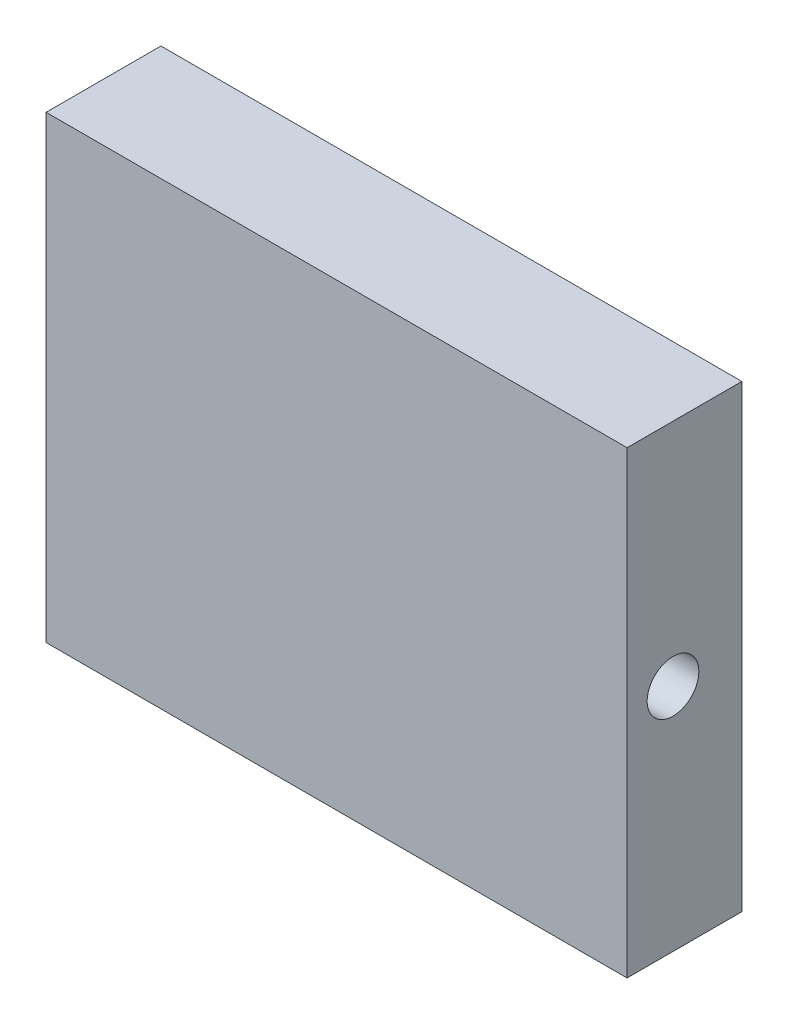
ISO-10303-21;
HEADER;
FILE_DESCRIPTION(('STEP AP214'),'2;1');
FILE_NAME('part.step','',(''),(''),'','','');
FILE_SCHEMA(('AUTOMOTIVE_DESIGN { 1 0 10303 214 1 1 1 1 }'));
ENDSEC;
DATA;
#1=APPLICATION_CONTEXT('core data for automotive mechanical design processes');
#2=APPLICATION_PROTOCOL_DEFINITION('international standard','automotive_design',2000,#1);
#3=PRODUCT_CONTEXT('',#1,'mechanical');
#4=PRODUCT('Part','Part','',(#3));
#5=PRODUCT_RELATED_PRODUCT_CATEGORY('part','',(#4));
#6=PRODUCT_DEFINITION_FORMATION('','',#4);
#7=PRODUCT_DEFINITION_CONTEXT('part definition',#1,'design');
#8=PRODUCT_DEFINITION('design','',#6,#7);
#9=PRODUCT_DEFINITION_SHAPE('','',#8);
#10=(LENGTH_UNIT() NAMED_UNIT(*) SI_UNIT(.MILLI.,.METRE.));
#11=(NAMED_UNIT(*) PLANE_ANGLE_UNIT() SI_UNIT($,.RADIAN.));
#12=(NAMED_UNIT(*) SI_UNIT($,.STERADIAN.) SOLID_ANGLE_UNIT());
#13=UNCERTAINTY_MEASURE_WITH_UNIT(LENGTH_MEASURE(1.E-05),#10,'distance_accuracy_value','');
#14=(GEOMETRIC_REPRESENTATION_CONTEXT(3) GLOBAL_UNCERTAINTY_ASSIGNED_CONTEXT((#13)) GLOBAL_UNIT_ASSIGNED_CONTEXT((#10,
#11,#12)) REPRESENTATION_CONTEXT('',''));
#15=CARTESIAN_POINT('',(0.,0.,0.));
#16=DIRECTION('',(0.,0.,1.));
#17=DIRECTION('',(1.,0.,0.));
#18=AXIS2_PLACEMENT_3D('',#15,#16,#17);
#19=CARTESIAN_POINT('',(0.,0.,10.));
#20=DIRECTION('',(1.,0.,0.));
#21=DIRECTION('',(0.,0.,-1.));
#22=AXIS2_PLACEMENT_3D('',#19,#20,#21);
#23=PLANE('',#22);
#24=DIRECTION('',(0.,-1.,0.));
#25=VECTOR('',#24,1.);
#26=CARTESIAN_POINT('',(0.,0.,0.));
#27=LINE('',#26,#25);
#28=CARTESIAN_POINT('',(0.,40.,0.));
#29=VERTEX_POINT('',#28);
#30=CARTESIAN_POINT('',(0.,0.,0.));
#31=VERTEX_POINT('',#30);
#32=EDGE_CURVE('E73',#29,#31,#27,.T.);
#33=ORIENTED_EDGE('',*,*,#32,.T.);
#34=DIRECTION('',(0.,0.,-1.));
#35=VECTOR('',#34,1.);
#36=CARTESIAN_POINT('',(0.,0.,10.));
#37=LINE('',#36,#35);
#38=CARTESIAN_POINT('',(0.,0.,10.));
#39=VERTEX_POINT('',#38);
#40=EDGE_CURVE('E11',#39,#31,#37,.T.);
#41=ORIENTED_EDGE('',*,*,#40,.F.);
#42=DIRECTION('',(0.,-1.,0.));
#43=VECTOR('',#42,1.);
#44=CARTESIAN_POINT('',(0.,0.,10.));
#45=LINE('',#44,#43);
#46=CARTESIAN_POINT('',(0.,40.,10.));
#47=VERTEX_POINT('',#46);
#48=EDGE_CURVE('E96',#47,#39,#45,.T.);
#49=ORIENTED_EDGE('',*,*,#48,.F.);
#50=DIRECTION('',(0.,0.,-1.));
#51=VECTOR('',#50,1.);
#52=CARTESIAN_POINT('',(0.,40.,10.));
#53=LINE('',#52,#51);
#54=EDGE_CURVE('E85',#47,#29,#53,.T.);
#55=ORIENTED_EDGE('',*,*,#54,.T.);
#56=EDGE_LOOP('',(#33,#41,#49,#55));
#57=FACE_BOUND('',#56,.T.);
#58=ADVANCED_FACE('F29',(#57),#23,.F.);
#59=CARTESIAN_POINT('',(0.,0.,10.));
#60=DIRECTION('',(0.,1.,0.));
#61=DIRECTION('',(0.,0.,1.));
#62=AXIS2_PLACEMENT_3D('',#59,#60,#61);
#63=PLANE('',#62);
#64=DIRECTION('',(1.,0.,0.));
#65=VECTOR('',#64,1.);
#66=CARTESIAN_POINT('',(0.,0.,0.));
#67=LINE('',#66,#65);
#68=CARTESIAN_POINT('',(50.6,0.,0.));
#69=VERTEX_POINT('',#68);
#70=EDGE_CURVE('E69',#31,#69,#67,.T.);
#71=ORIENTED_EDGE('',*,*,#70,.T.);
#72=DIRECTION('',(0.,0.,-1.));
#73=VECTOR('',#72,1.);
#74=CARTESIAN_POINT('',(50.6,0.,10.));
#75=LINE('',#74,#73);
#76=CARTESIAN_POINT('',(50.6,0.,10.));
#77=VERTEX_POINT('',#76);
#78=EDGE_CURVE('E36',#77,#69,#75,.T.);
#79=ORIENTED_EDGE('',*,*,#78,.F.);
#80=DIRECTION('',(1.,0.,0.));
#81=VECTOR('',#80,1.);
#82=CARTESIAN_POINT('',(0.,0.,10.));
#83=LINE('',#82,#81);
#84=EDGE_CURVE('E81',#39,#77,#83,.T.);
#85=ORIENTED_EDGE('',*,*,#84,.F.);
#86=ORIENTED_EDGE('',*,*,#40,.T.);
#87=EDGE_LOOP('',(#71,#79,#85,#86));
#88=FACE_BOUND('',#87,.T.);
#89=ADVANCED_FACE('F80',(#88),#63,.F.);
#90=CARTESIAN_POINT('',(50.6,0.,10.));
#91=DIRECTION('',(-1.,0.,0.));
#92=DIRECTION('',(0.,0.,1.));
#93=AXIS2_PLACEMENT_3D('',#90,#91,#92);
#94=PLANE('',#93);
#95=CARTESIAN_POINT('',(50.6,20.,5.99999999999995));
#96=DIRECTION('',(1.,0.,0.));
#97=DIRECTION('',(0.,0.,-1.));
#98=AXIS2_PLACEMENT_3D('',#95,#96,#97);
#99=CIRCLE('',#98,2.25);
#100=CARTESIAN_POINT('',(50.6,20.,3.74999999999995));
#101=VERTEX_POINT('',#100);
#102=EDGE_CURVE('E89',#101,#101,#99,.T.);
#103=ORIENTED_EDGE('',*,*,#102,.F.);
#104=EDGE_LOOP('',(#103));
#105=FACE_BOUND('',#104,.T.);
#106=DIRECTION('',(0.,1.,0.));
#107=VECTOR('',#106,1.);
#108=CARTESIAN_POINT('',(50.6,0.,0.));
#109=LINE('',#108,#107);
#110=CARTESIAN_POINT('',(50.6,40.,0.));
#111=VERTEX_POINT('',#110);
#112=EDGE_CURVE('E74',#69,#111,#109,.T.);
#113=ORIENTED_EDGE('',*,*,#112,.T.);
#114=DIRECTION('',(0.,0.,-1.));
#115=VECTOR('',#114,1.);
#116=CARTESIAN_POINT('',(50.6,40.,10.));
#117=LINE('',#116,#115);
#118=CARTESIAN_POINT('',(50.6,40.,10.));
#119=VERTEX_POINT('',#118);
#120=EDGE_CURVE('E102',#119,#111,#117,.T.);
#121=ORIENTED_EDGE('',*,*,#120,.F.);
#122=DIRECTION('',(0.,1.,0.));
#123=VECTOR('',#122,1.);
#124=CARTESIAN_POINT('',(50.6,0.,10.));
#125=LINE('',#124,#123);
#126=EDGE_CURVE('E48',#77,#119,#125,.T.);
#127=ORIENTED_EDGE('',*,*,#126,.F.);
#128=ORIENTED_EDGE('',*,*,#78,.T.);
#129=EDGE_LOOP('',(#113,#121,#127,#128));
#130=FACE_BOUND('',#129,.T.);
#131=ADVANCED_FACE('F105',(#105,#130),#94,.F.);
#132=CARTESIAN_POINT('',(0.,40.,10.));
#133=DIRECTION('',(0.,-1.,0.));
#134=DIRECTION('',(0.,0.,-1.));
#135=AXIS2_PLACEMENT_3D('',#132,#133,#134);
#136=PLANE('',#135);
#137=DIRECTION('',(-1.,0.,0.));
#138=VECTOR('',#137,1.);
#139=CARTESIAN_POINT('',(0.,40.,0.));
#140=LINE('',#139,#138);
#141=EDGE_CURVE('E94',#111,#29,#140,.T.);
#142=ORIENTED_EDGE('',*,*,#141,.T.);
#143=ORIENTED_EDGE('',*,*,#54,.F.);
#144=DIRECTION('',(-1.,0.,0.));
#145=VECTOR('',#144,1.);
#146=CARTESIAN_POINT('',(0.,40.,10.));
#147=LINE('',#146,#145);
#148=EDGE_CURVE('E43',#119,#47,#147,.T.);
#149=ORIENTED_EDGE('',*,*,#148,.F.);
#150=ORIENTED_EDGE('',*,*,#120,.T.);
#151=EDGE_LOOP('',(#142,#143,#149,#150));
#152=FACE_BOUND('',#151,.T.);
#153=ADVANCED_FACE('F107',(#152),#136,.F.);
#154=CARTESIAN_POINT('',(0.,40.,10.));
#155=DIRECTION('',(0.,0.,-1.));
#156=DIRECTION('',(-1.,0.,0.));
#157=AXIS2_PLACEMENT_3D('',#154,#155,#156);
#158=PLANE('',#157);
#159=ORIENTED_EDGE('',*,*,#48,.T.);
#160=ORIENTED_EDGE('',*,*,#84,.T.);
#161=ORIENTED_EDGE('',*,*,#126,.T.);
#162=ORIENTED_EDGE('',*,*,#148,.T.);
#163=EDGE_LOOP('',(#159,#160,#161,#162));
#164=FACE_BOUND('',#163,.T.);
#165=ADVANCED_FACE('F108',(#164),#158,.F.);
#166=CARTESIAN_POINT('',(0.,40.,0.));
#167=DIRECTION('',(0.,0.,-1.));
#168=DIRECTION('',(-1.,0.,0.));
#169=AXIS2_PLACEMENT_3D('',#166,#167,#168);
#170=PLANE('',#169);
#171=ORIENTED_EDGE('',*,*,#32,.F.);
#172=ORIENTED_EDGE('',*,*,#141,.F.);
#173=ORIENTED_EDGE('',*,*,#112,.F.);
#174=ORIENTED_EDGE('',*,*,#70,.F.);
#175=EDGE_LOOP('',(#171,#172,#173,#174));
#176=FACE_BOUND('',#175,.T.);
#177=ADVANCED_FACE('F70',(#176),#170,.T.);
#178=CARTESIAN_POINT('',(40.6,20.,5.99999999999995));
#179=DIRECTION('',(1.,0.,0.));
#180=DIRECTION('',(0.,0.,-1.));
#181=AXIS2_PLACEMENT_3D('',#178,#179,#180);
#182=CYLINDRICAL_SURFACE('',#181,2.25);
#183=CARTESIAN_POINT('',(40.6,20.,5.99999999999995));
#184=DIRECTION('',(1.,0.,0.));
#185=DIRECTION('',(0.,0.,-1.));
#186=AXIS2_PLACEMENT_3D('',#183,#184,#185);
#187=CIRCLE('',#186,2.25);
#188=CARTESIAN_POINT('',(40.6,20.,3.74999999999995));
#189=VERTEX_POINT('',#188);
#190=EDGE_CURVE('E86',#189,#189,#187,.T.);
#191=ORIENTED_EDGE('',*,*,#190,.F.);
#192=EDGE_LOOP('',(#191));
#193=FACE_BOUND('',#192,.T.);
#194=ORIENTED_EDGE('',*,*,#102,.T.);
#195=EDGE_LOOP('',(#194));
#196=FACE_BOUND('',#195,.T.);
#197=ADVANCED_FACE('F115',(#193,#196),#182,.F.);
#198=CARTESIAN_POINT('',(40.6,20.,5.99999999999995));
#199=DIRECTION('',(1.,0.,0.));
#200=DIRECTION('',(0.,0.,-1.));
#201=AXIS2_PLACEMENT_3D('',#198,#199,#200);
#202=PLANE('',#201);
#203=ORIENTED_EDGE('',*,*,#190,.T.);
#204=EDGE_LOOP('',(#203));
#205=FACE_BOUND('',#204,.T.);
#206=ADVANCED_FACE('F133',(#205),#202,.T.);
#207=CLOSED_SHELL('',(#58,#89,#131,#153,#165,#177,#197,#206));
#208=MANIFOLD_SOLID_BREP('B2',#207);
#209=ADVANCED_BREP_SHAPE_REPRESENTATION('',(#18,#208),#14);
#210=SHAPE_DEFINITION_REPRESENTATION(#9,#209);
ENDSEC;
END-ISO-10303-21;
